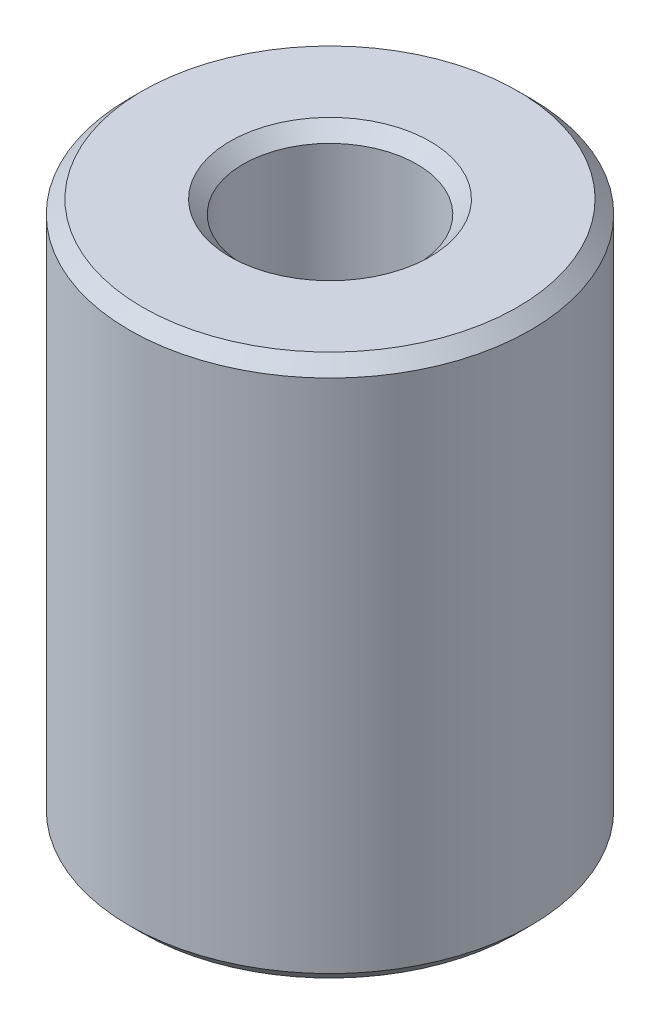
ISO-10303-21;
HEADER;
FILE_DESCRIPTION(('STEP AP214'),'2;1');
FILE_NAME('part.step','',(''),(''),'','','');
FILE_SCHEMA(('AUTOMOTIVE_DESIGN { 1 0 10303 214 1 1 1 1 }'));
ENDSEC;
DATA;
#1=APPLICATION_CONTEXT('core data for automotive mechanical design processes');
#2=APPLICATION_PROTOCOL_DEFINITION('international standard','automotive_design',2000,#1);
#3=PRODUCT_CONTEXT('',#1,'mechanical');
#4=PRODUCT('Part','Part','',(#3));
#5=PRODUCT_RELATED_PRODUCT_CATEGORY('part','',(#4));
#6=PRODUCT_DEFINITION_FORMATION('','',#4);
#7=PRODUCT_DEFINITION_CONTEXT('part definition',#1,'design');
#8=PRODUCT_DEFINITION('design','',#6,#7);
#9=PRODUCT_DEFINITION_SHAPE('','',#8);
#10=(LENGTH_UNIT() NAMED_UNIT(*) SI_UNIT(.MILLI.,.METRE.));
#11=(NAMED_UNIT(*) PLANE_ANGLE_UNIT() SI_UNIT($,.RADIAN.));
#12=(NAMED_UNIT(*) SI_UNIT($,.STERADIAN.) SOLID_ANGLE_UNIT());
#13=UNCERTAINTY_MEASURE_WITH_UNIT(LENGTH_MEASURE(1.E-05),#10,'distance_accuracy_value','');
#14=(GEOMETRIC_REPRESENTATION_CONTEXT(3) GLOBAL_UNCERTAINTY_ASSIGNED_CONTEXT((#13)) GLOBAL_UNIT_ASSIGNED_CONTEXT((#10,
#11,#12)) REPRESENTATION_CONTEXT('',''));
#15=CARTESIAN_POINT('',(0.,0.,0.));
#16=DIRECTION('',(0.,0.,1.));
#17=DIRECTION('',(1.,0.,0.));
#18=AXIS2_PLACEMENT_3D('',#15,#16,#17);
#19=CARTESIAN_POINT('',(0.,33.7737403149457,0.));
#20=DIRECTION('',(0.,-1.,0.));
#21=DIRECTION('',(0.,0.,-1.));
#22=AXIS2_PLACEMENT_3D('',#19,#20,#21);
#23=CYLINDRICAL_SURFACE('',#22,12.5);
#24=CARTESIAN_POINT('',(0.,0.821694140965064,0.));
#25=DIRECTION('',(0.,1.,0.));
#26=DIRECTION('',(0.,0.,1.));
#27=AXIS2_PLACEMENT_3D('',#24,#25,#26);
#28=CIRCLE('',#27,12.5);
#29=CARTESIAN_POINT('',(0.,0.821694140965064,12.5));
#30=VERTEX_POINT('',#29);
#31=EDGE_CURVE('E10',#30,#30,#28,.T.);
#32=ORIENTED_EDGE('',*,*,#31,.T.);
#33=EDGE_LOOP('',(#32));
#34=FACE_BOUND('',#33,.T.);
#35=CARTESIAN_POINT('',(0.,32.9520461739807,0.));
#36=DIRECTION('',(0.,1.,0.));
#37=DIRECTION('',(0.,0.,1.));
#38=AXIS2_PLACEMENT_3D('',#35,#36,#37);
#39=CIRCLE('',#38,12.5);
#40=CARTESIAN_POINT('',(0.,32.9520461739807,12.5));
#41=VERTEX_POINT('',#40);
#42=EDGE_CURVE('E50',#41,#41,#39,.F.);
#43=ORIENTED_EDGE('',*,*,#42,.T.);
#44=EDGE_LOOP('',(#43));
#45=FACE_BOUND('',#44,.T.);
#46=ADVANCED_FACE('F39',(#34,#45),#23,.T.);
#47=CARTESIAN_POINT('',(0.,33.7737403149457,0.));
#48=DIRECTION('',(0.,1.,0.));
#49=DIRECTION('',(0.,0.,1.));
#50=AXIS2_PLACEMENT_3D('',#47,#48,#49);
#51=PLANE('',#50);
#52=CARTESIAN_POINT('',(0.,33.7737403149457,0.));
#53=DIRECTION('',(0.,1.,0.));
#54=DIRECTION('',(0.,0.,1.));
#55=AXIS2_PLACEMENT_3D('',#52,#53,#54);
#56=CIRCLE('',#55,6.2329710428054);
#57=CARTESIAN_POINT('',(0.,33.7737403149457,6.2329710428054));
#58=VERTEX_POINT('',#57);
#59=EDGE_CURVE('E58',#58,#58,#56,.F.);
#60=ORIENTED_EDGE('',*,*,#59,.T.);
#61=EDGE_LOOP('',(#60));
#62=FACE_BOUND('',#61,.T.);
#63=CARTESIAN_POINT('',(0.,33.7737403149457,0.));
#64=DIRECTION('',(0.,1.,0.));
#65=DIRECTION('',(0.,0.,1.));
#66=AXIS2_PLACEMENT_3D('',#63,#64,#65);
#67=CIRCLE('',#66,11.6783058590349);
#68=CARTESIAN_POINT('',(0.,33.7737403149457,11.6783058590349));
#69=VERTEX_POINT('',#68);
#70=EDGE_CURVE('E61',#69,#69,#67,.T.);
#71=ORIENTED_EDGE('',*,*,#70,.T.);
#72=EDGE_LOOP('',(#71));
#73=FACE_BOUND('',#72,.T.);
#74=ADVANCED_FACE('F88',(#62,#73),#51,.T.);
#75=CARTESIAN_POINT('',(0.,0.,0.));
#76=DIRECTION('',(0.,1.,0.));
#77=DIRECTION('',(0.,0.,1.));
#78=AXIS2_PLACEMENT_3D('',#75,#76,#77);
#79=PLANE('',#78);
#80=CARTESIAN_POINT('',(0.,0.,0.));
#81=DIRECTION('',(0.,1.,0.));
#82=DIRECTION('',(0.,0.,1.));
#83=AXIS2_PLACEMENT_3D('',#80,#81,#82);
#84=CIRCLE('',#83,6.23297104280541);
#85=CARTESIAN_POINT('',(0.,0.,6.23297104280541));
#86=VERTEX_POINT('',#85);
#87=EDGE_CURVE('E51',#86,#86,#84,.T.);
#88=ORIENTED_EDGE('',*,*,#87,.T.);
#89=EDGE_LOOP('',(#88));
#90=FACE_BOUND('',#89,.T.);
#91=CARTESIAN_POINT('',(0.,0.,0.));
#92=DIRECTION('',(0.,1.,0.));
#93=DIRECTION('',(0.,0.,1.));
#94=AXIS2_PLACEMENT_3D('',#91,#92,#93);
#95=CIRCLE('',#94,11.6783058590349);
#96=CARTESIAN_POINT('',(0.,0.,11.6783058590349));
#97=VERTEX_POINT('',#96);
#98=EDGE_CURVE('E54',#97,#97,#95,.F.);
#99=ORIENTED_EDGE('',*,*,#98,.T.);
#100=EDGE_LOOP('',(#99));
#101=FACE_BOUND('',#100,.T.);
#102=ADVANCED_FACE('F83',(#90,#101),#79,.F.);
#103=CARTESIAN_POINT('',(0.,33.7737403149457,0.));
#104=DIRECTION('',(0.,-1.,0.));
#105=DIRECTION('',(0.,0.,-1.));
#106=AXIS2_PLACEMENT_3D('',#103,#104,#105);
#107=CYLINDRICAL_SURFACE('',#106,5.41127690184035);
#108=CARTESIAN_POINT('',(0.,32.9520461739807,0.));
#109=DIRECTION('',(0.,1.,0.));
#110=DIRECTION('',(0.,0.,1.));
#111=AXIS2_PLACEMENT_3D('',#108,#109,#110);
#112=CIRCLE('',#111,5.41127690184035);
#113=CARTESIAN_POINT('',(0.,32.9520461739807,5.41127690184035));
#114=VERTEX_POINT('',#113);
#115=EDGE_CURVE('E67',#114,#114,#112,.T.);
#116=ORIENTED_EDGE('',*,*,#115,.T.);
#117=EDGE_LOOP('',(#116));
#118=FACE_BOUND('',#117,.T.);
#119=CARTESIAN_POINT('',(0.,0.821694140965064,0.));
#120=DIRECTION('',(0.,1.,0.));
#121=DIRECTION('',(0.,0.,1.));
#122=AXIS2_PLACEMENT_3D('',#119,#120,#121);
#123=CIRCLE('',#122,5.41127690184035);
#124=CARTESIAN_POINT('',(0.,0.821694140965064,5.41127690184035));
#125=VERTEX_POINT('',#124);
#126=EDGE_CURVE('E69',#125,#125,#123,.F.);
#127=ORIENTED_EDGE('',*,*,#126,.T.);
#128=EDGE_LOOP('',(#127));
#129=FACE_BOUND('',#128,.T.);
#130=ADVANCED_FACE('F71',(#118,#129),#107,.F.);
#131=CARTESIAN_POINT('',(0.,32.9520461739807,0.));
#132=DIRECTION('',(0.,1.,0.));
#133=DIRECTION('',(0.,0.,1.));
#134=AXIS2_PLACEMENT_3D('',#131,#132,#133);
#135=CONICAL_SURFACE('',#134,5.41127690184035,0.785398163397448);
#136=CARTESIAN_POINT('',(0.,33.7737403149457,6.2329710428054));
#137=CARTESIAN_POINT('',(0.,33.7651810009773,6.22441172883701));
#138=CARTESIAN_POINT('',(0.,33.756621687009,6.21585241486863));
#139=CARTESIAN_POINT('',(0.,33.7395030590722,6.19873378693186));
#140=CARTESIAN_POINT('',(0.,33.7309437451038,6.19017447296347));
#141=CARTESIAN_POINT('',(0.,33.713825117167,6.1730558450267));
#142=CARTESIAN_POINT('',(0.,33.7052658031986,6.16449653105831));
#143=CARTESIAN_POINT('',(0.,33.6881471752619,6.14737790312154));
#144=CARTESIAN_POINT('',(0.,33.6795878612935,6.13881858915315));
#145=CARTESIAN_POINT('',(0.,33.6624692333567,6.12169996121638));
#146=CARTESIAN_POINT('',(0.,33.6539099193883,6.113140647248));
#147=CARTESIAN_POINT('',(0.,33.6367912914516,6.09602201931122));
#148=CARTESIAN_POINT('',(0.,33.6282319774832,6.08746270534284));
#149=CARTESIAN_POINT('',(0.,33.6111133495464,6.07034407740607));
#150=CARTESIAN_POINT('',(0.,33.602554035578,6.06178476343768));
#151=CARTESIAN_POINT('',(0.,33.5854354076412,6.04466613550091));
#152=CARTESIAN_POINT('',(0.,33.5768760936728,6.03610682153252));
#153=CARTESIAN_POINT('',(0.,33.5597574657361,6.01898819359575));
#154=CARTESIAN_POINT('',(0.,33.5511981517677,6.01042887962736));
#155=CARTESIAN_POINT('',(0.,33.5340795238309,5.99331025169059));
#156=CARTESIAN_POINT('',(0.,33.5255202098625,5.98475093772221));
#157=CARTESIAN_POINT('',(0.,33.5084015819258,5.96763230978544));
#158=CARTESIAN_POINT('',(0.,33.4998422679574,5.95907299581705));
#159=CARTESIAN_POINT('',(0.,33.4827236400206,5.94195436788028));
#160=CARTESIAN_POINT('',(0.,33.4741643260522,5.93339505391189));
#161=CARTESIAN_POINT('',(0.,33.4570456981154,5.91627642597512));
#162=CARTESIAN_POINT('',(0.,33.4484863841471,5.90771711200673));
#163=CARTESIAN_POINT('',(0.,33.4313677562103,5.89059848406996));
#164=CARTESIAN_POINT('',(0.,33.4228084422419,5.88203917010158));
#165=CARTESIAN_POINT('',(0.,33.4056898143051,5.8649205421648));
#166=CARTESIAN_POINT('',(0.,33.3971305003367,5.85636122819642));
#167=CARTESIAN_POINT('',(0.,33.3800118724,5.83924260025964));
#168=CARTESIAN_POINT('',(0.,33.3714525584316,5.83068328629126));
#169=CARTESIAN_POINT('',(0.,33.3543339304948,5.81356465835449));
#170=CARTESIAN_POINT('',(0.,33.3457746165264,5.8050053443861));
#171=CARTESIAN_POINT('',(0.,33.3286559885897,5.78788671644933));
#172=CARTESIAN_POINT('',(0.,33.3200966746213,5.77932740248094));
#173=CARTESIAN_POINT('',(0.,33.3029780466845,5.76220877454417));
#174=CARTESIAN_POINT('',(0.,33.2944187327161,5.75364946057579));
#175=CARTESIAN_POINT('',(0.,33.2773001047793,5.73653083263901));
#176=CARTESIAN_POINT('',(0.,33.268740790811,5.72797151867063));
#177=CARTESIAN_POINT('',(0.,33.2516221628742,5.71085289073386));
#178=CARTESIAN_POINT('',(0.,33.2430628489058,5.70229357676547));
#179=CARTESIAN_POINT('',(0.,33.225944220969,5.6851749488287));
#180=CARTESIAN_POINT('',(0.,33.2173849070006,5.67661563486031));
#181=CARTESIAN_POINT('',(0.,33.2002662790639,5.65949700692354));
#182=CARTESIAN_POINT('',(0.,33.1917069650955,5.65093769295516));
#183=CARTESIAN_POINT('',(0.,33.1745883371587,5.63381906501838));
#184=CARTESIAN_POINT('',(0.,33.1660290231903,5.62525975105));
#185=CARTESIAN_POINT('',(0.,33.1489103952536,5.60814112311323));
#186=CARTESIAN_POINT('',(0.,33.1403510812852,5.59958180914484));
#187=CARTESIAN_POINT('',(0.,33.1232324533484,5.58246318120807));
#188=CARTESIAN_POINT('',(0.,33.11467313938,5.57390386723968));
#189=CARTESIAN_POINT('',(0.,33.0975545114432,5.55678523930291));
#190=CARTESIAN_POINT('',(0.,33.0889951974748,5.54822592533452));
#191=CARTESIAN_POINT('',(0.,33.0718765695381,5.53110729739775));
#192=CARTESIAN_POINT('',(0.,33.0633172555697,5.52254798342937));
#193=CARTESIAN_POINT('',(0.,33.0461986276329,5.50542935549259));
#194=CARTESIAN_POINT('',(0.,33.0376393136645,5.49687004152421));
#195=CARTESIAN_POINT('',(0.,33.0205206857278,5.47975141358744));
#196=CARTESIAN_POINT('',(0.,33.0119613717594,5.47119209961905));
#197=CARTESIAN_POINT('',(0.,32.9948427438226,5.45407347168228));
#198=CARTESIAN_POINT('',(0.,32.9862834298542,5.44551415771389));
#199=CARTESIAN_POINT('',(0.,32.9691648019174,5.42839552977712));
#200=CARTESIAN_POINT('',(0.,32.9606054879491,5.41983621580874));
#201=CARTESIAN_POINT('',(0.,32.9520461739807,5.41127690184035));
#202=B_SPLINE_CURVE_WITH_KNOTS('',3,(#136,#137,#138,#139,#140,#141,#142,#143,#144,#145,#146,
#147,#148,#149,#150,#151,#152,#153,#154,#155,#156,#157,#158,#159,#160,#161,#162,#163,#164,#165,
#166,#167,#168,#169,#170,#171,#172,#173,#174,#175,#176,#177,#178,#179,#180,#181,#182,#183,#184,
#185,#186,#187,#188,#189,#190,#191,#192,#193,#194,#195,#196,#197,#198,#199,#200,#201),
.UNSPECIFIED.,.F.,.F.,(4,2,2,2,2,2,2,2,2,2,2,2,2,2,2,2,2,2,2,2,2,2,2,2,2,2,2,2,2,2,2,2,4),(0.,
0.0363140936961035,0.0726281873922077,0.108942281088312,0.14525637478441,0.181570468480515,
0.217884562176619,0.254198655872723,0.290512749568822,0.326826843264926,0.36314093696103,
0.399455030657128,0.435769124353233,0.472083218049337,0.508397311745441,0.54471140544154,
0.581025499137644,0.617339592833748,0.653653686529847,0.689967780225951,0.726281873922055,
0.762595967618159,0.798910061314258,0.835224155010362,0.871538248706466,0.907852342402565,
0.944166436098669,0.980480529794772,1.01679462349088,1.05310871718698,1.08942281088308,
1.12573690457918,1.16205099827528),.UNSPECIFIED.);
#203=EDGE_CURVE('BSEAM77',#58,#114,#202,.T.);
#204=ORIENTED_EDGE('',*,*,#59,.F.);
#205=ORIENTED_EDGE('',*,*,#115,.F.);
#206=ORIENTED_EDGE('',*,*,#203,.T.);
#207=ORIENTED_EDGE('',*,*,#203,.F.);
#208=EDGE_LOOP('',(#204,#206,#205,#207));
#209=FACE_BOUND('',#208,.T.);
#210=ADVANCED_FACE('F77',(#209),#135,.F.);
#211=CARTESIAN_POINT('',(0.,0.,0.));
#212=DIRECTION('',(0.,-1.,0.));
#213=DIRECTION('',(0.,0.,-1.));
#214=AXIS2_PLACEMENT_3D('',#211,#212,#213);
#215=CONICAL_SURFACE('',#214,6.23297104280541,0.785398163397444);
#216=ORIENTED_EDGE('',*,*,#126,.F.);
#217=EDGE_LOOP('',(#216));
#218=FACE_BOUND('',#217,.T.);
#219=ORIENTED_EDGE('',*,*,#87,.F.);
#220=EDGE_LOOP('',(#219));
#221=FACE_BOUND('',#220,.T.);
#222=ADVANCED_FACE('F73',(#218,#221),#215,.F.);
#223=CARTESIAN_POINT('',(0.,0.821694140965064,0.));
#224=DIRECTION('',(0.,1.,0.));
#225=DIRECTION('',(0.,0.,1.));
#226=AXIS2_PLACEMENT_3D('',#223,#224,#225);
#227=CONICAL_SURFACE('',#226,12.5,0.785398163397451);
#228=ORIENTED_EDGE('',*,*,#98,.F.);
#229=EDGE_LOOP('',(#228));
#230=FACE_BOUND('',#229,.T.);
#231=ORIENTED_EDGE('',*,*,#31,.F.);
#232=EDGE_LOOP('',(#231));
#233=FACE_BOUND('',#232,.T.);
#234=ADVANCED_FACE('F76',(#230,#233),#227,.T.);
#235=CARTESIAN_POINT('',(0.,33.7737403149457,0.));
#236=DIRECTION('',(0.,-1.,0.));
#237=DIRECTION('',(0.,0.,-1.));
#238=AXIS2_PLACEMENT_3D('',#235,#236,#237);
#239=CONICAL_SURFACE('',#238,11.6783058590349,0.785398163397447);
#240=ORIENTED_EDGE('',*,*,#42,.F.);
#241=EDGE_LOOP('',(#240));
#242=FACE_BOUND('',#241,.T.);
#243=ORIENTED_EDGE('',*,*,#70,.F.);
#244=EDGE_LOOP('',(#243));
#245=FACE_BOUND('',#244,.T.);
#246=ADVANCED_FACE('F45',(#242,#245),#239,.T.);
#247=CLOSED_SHELL('',(#46,#74,#102,#130,#210,#222,#234,#246));
#248=MANIFOLD_SOLID_BREP('B2',#247);
#249=ADVANCED_BREP_SHAPE_REPRESENTATION('',(#18,#248),#14);
#250=SHAPE_DEFINITION_REPRESENTATION(#9,#249);
ENDSEC;
END-ISO-10303-21;
